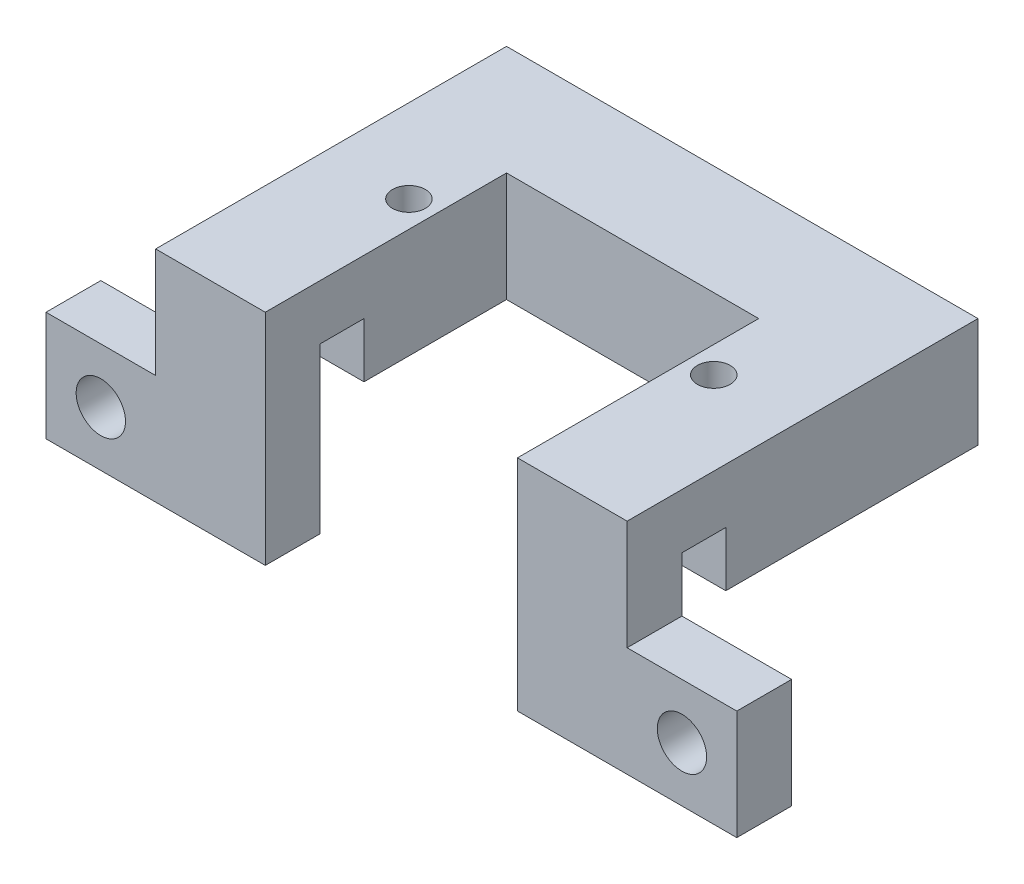
ISO-10303-21;
HEADER;
FILE_DESCRIPTION(('STEP AP214'),'2;1');
FILE_NAME('part.step','',(''),(''),'','','');
FILE_SCHEMA(('AUTOMOTIVE_DESIGN { 1 0 10303 214 1 1 1 1 }'));
ENDSEC;
DATA;
#1=APPLICATION_CONTEXT('core data for automotive mechanical design processes');
#2=APPLICATION_PROTOCOL_DEFINITION('international standard','automotive_design',2000,#1);
#3=PRODUCT_CONTEXT('',#1,'mechanical');
#4=PRODUCT('Part','Part','',(#3));
#5=PRODUCT_RELATED_PRODUCT_CATEGORY('part','',(#4));
#6=PRODUCT_DEFINITION_FORMATION('','',#4);
#7=PRODUCT_DEFINITION_CONTEXT('part definition',#1,'design');
#8=PRODUCT_DEFINITION('design','',#6,#7);
#9=PRODUCT_DEFINITION_SHAPE('','',#8);
#10=(LENGTH_UNIT() NAMED_UNIT(*) SI_UNIT(.MILLI.,.METRE.));
#11=(NAMED_UNIT(*) PLANE_ANGLE_UNIT() SI_UNIT($,.RADIAN.));
#12=(NAMED_UNIT(*) SI_UNIT($,.STERADIAN.) SOLID_ANGLE_UNIT());
#13=UNCERTAINTY_MEASURE_WITH_UNIT(LENGTH_MEASURE(1.E-05),#10,'distance_accuracy_value','');
#14=(GEOMETRIC_REPRESENTATION_CONTEXT(3) GLOBAL_UNCERTAINTY_ASSIGNED_CONTEXT((#13)) GLOBAL_UNIT_ASSIGNED_CONTEXT((#10,
#11,#12)) REPRESENTATION_CONTEXT('',''));
#15=CARTESIAN_POINT('',(0.,0.,0.));
#16=DIRECTION('',(0.,0.,1.));
#17=DIRECTION('',(1.,0.,0.));
#18=AXIS2_PLACEMENT_3D('',#15,#16,#17);
#19=CARTESIAN_POINT('',(21.5,10.,23.));
#20=DIRECTION('',(-1.,0.,0.));
#21=DIRECTION('',(0.,0.,1.));
#22=AXIS2_PLACEMENT_3D('',#19,#20,#21);
#23=PLANE('',#22);
#24=DIRECTION('',(0.,0.,1.));
#25=VECTOR('',#24,1.);
#26=CARTESIAN_POINT('',(21.5,0.,27.));
#27=LINE('',#26,#25);
#28=CARTESIAN_POINT('',(21.5,0.,27.));
#29=VERTEX_POINT('',#28);
#30=CARTESIAN_POINT('',(21.5,0.,32.));
#31=VERTEX_POINT('',#30);
#32=EDGE_CURVE('E54',#29,#31,#27,.T.);
#33=ORIENTED_EDGE('',*,*,#32,.F.);
#34=DIRECTION('',(0.,-1.,0.));
#35=VECTOR('',#34,1.);
#36=CARTESIAN_POINT('',(21.5,0.,27.));
#37=LINE('',#36,#35);
#38=CARTESIAN_POINT('',(21.5,5.,27.));
#39=VERTEX_POINT('',#38);
#40=EDGE_CURVE('E255',#39,#29,#37,.T.);
#41=ORIENTED_EDGE('',*,*,#40,.F.);
#42=DIRECTION('',(0.,0.,1.));
#43=VECTOR('',#42,1.);
#44=CARTESIAN_POINT('',(21.5,5.,27.));
#45=LINE('',#44,#43);
#46=CARTESIAN_POINT('',(21.5,5.,23.));
#47=VERTEX_POINT('',#46);
#48=EDGE_CURVE('E241',#47,#39,#45,.T.);
#49=ORIENTED_EDGE('',*,*,#48,.F.);
#50=DIRECTION('',(0.,1.,0.));
#51=VECTOR('',#50,1.);
#52=CARTESIAN_POINT('',(21.5,5.,23.));
#53=LINE('',#52,#51);
#54=CARTESIAN_POINT('',(21.5,0.,23.));
#55=VERTEX_POINT('',#54);
#56=EDGE_CURVE('E246',#55,#47,#53,.T.);
#57=ORIENTED_EDGE('',*,*,#56,.F.);
#58=DIRECTION('',(0.,0.,-1.));
#59=VECTOR('',#58,1.);
#60=CARTESIAN_POINT('',(21.5,0.,23.));
#61=LINE('',#60,#59);
#62=CARTESIAN_POINT('',(21.5,0.,0.));
#63=VERTEX_POINT('',#62);
#64=EDGE_CURVE('E313',#55,#63,#61,.T.);
#65=ORIENTED_EDGE('',*,*,#64,.T.);
#66=DIRECTION('',(0.,-1.,0.));
#67=VECTOR('',#66,1.);
#68=CARTESIAN_POINT('',(21.5,10.,0.));
#69=LINE('',#68,#67);
#70=CARTESIAN_POINT('',(21.5,10.,0.));
#71=VERTEX_POINT('',#70);
#72=EDGE_CURVE('E323',#71,#63,#69,.T.);
#73=ORIENTED_EDGE('',*,*,#72,.F.);
#74=DIRECTION('',(0.,0.,-1.));
#75=VECTOR('',#74,1.);
#76=CARTESIAN_POINT('',(21.5,10.,23.));
#77=LINE('',#76,#75);
#78=CARTESIAN_POINT('',(21.5,10.,32.));
#79=VERTEX_POINT('',#78);
#80=EDGE_CURVE('E177',#79,#71,#77,.T.);
#81=ORIENTED_EDGE('',*,*,#80,.F.);
#82=DIRECTION('',(0.,1.,0.));
#83=VECTOR('',#82,1.);
#84=CARTESIAN_POINT('',(21.5,0.,32.));
#85=LINE('',#84,#83);
#86=EDGE_CURVE('E175',#31,#79,#85,.T.);
#87=ORIENTED_EDGE('',*,*,#86,.F.);
#88=EDGE_LOOP('',(#33,#41,#49,#57,#65,#73,#81,#87));
#89=FACE_BOUND('',#88,.T.);
#90=ADVANCED_FACE('F37',(#89),#23,.F.);
#91=CARTESIAN_POINT('',(0.,0.,0.));
#92=DIRECTION('',(0.,1.,0.));
#93=DIRECTION('',(0.,0.,1.));
#94=AXIS2_PLACEMENT_3D('',#91,#92,#93);
#95=PLANE('',#94);
#96=CARTESIAN_POINT('',(-13.9,0.,16.5));
#97=DIRECTION('',(0.,1.,0.));
#98=DIRECTION('',(0.,0.,1.));
#99=AXIS2_PLACEMENT_3D('',#96,#97,#98);
#100=CIRCLE('',#99,1.5);
#101=CARTESIAN_POINT('',(-13.9,0.,18.));
#102=VERTEX_POINT('',#101);
#103=EDGE_CURVE('E297',#102,#102,#100,.T.);
#104=ORIENTED_EDGE('',*,*,#103,.T.);
#105=EDGE_LOOP('',(#104));
#106=FACE_BOUND('',#105,.T.);
#107=CARTESIAN_POINT('',(13.9,0.,16.5));
#108=DIRECTION('',(0.,1.,0.));
#109=DIRECTION('',(0.,0.,1.));
#110=AXIS2_PLACEMENT_3D('',#107,#108,#109);
#111=CIRCLE('',#110,1.5);
#112=CARTESIAN_POINT('',(13.9,0.,18.));
#113=VERTEX_POINT('',#112);
#114=EDGE_CURVE('E295',#113,#113,#111,.T.);
#115=ORIENTED_EDGE('',*,*,#114,.T.);
#116=EDGE_LOOP('',(#115));
#117=FACE_BOUND('',#116,.T.);
#118=ORIENTED_EDGE('',*,*,#64,.F.);
#119=DIRECTION('',(-1.,0.,0.));
#120=VECTOR('',#119,1.);
#121=CARTESIAN_POINT('',(0.,0.,23.));
#122=LINE('',#121,#120);
#123=CARTESIAN_POINT('',(11.5,0.,23.));
#124=VERTEX_POINT('',#123);
#125=EDGE_CURVE('E11',#55,#124,#122,.T.);
#126=ORIENTED_EDGE('',*,*,#125,.T.);
#127=DIRECTION('',(0.,0.,1.));
#128=VECTOR('',#127,1.);
#129=CARTESIAN_POINT('',(11.5,0.,10.));
#130=LINE('',#129,#128);
#131=CARTESIAN_POINT('',(11.5,0.,10.));
#132=VERTEX_POINT('',#131);
#133=EDGE_CURVE('E333',#132,#124,#130,.T.);
#134=ORIENTED_EDGE('',*,*,#133,.F.);
#135=DIRECTION('',(1.,0.,0.));
#136=VECTOR('',#135,1.);
#137=CARTESIAN_POINT('',(-11.5,0.,10.));
#138=LINE('',#137,#136);
#139=CARTESIAN_POINT('',(-11.5,0.,10.));
#140=VERTEX_POINT('',#139);
#141=EDGE_CURVE('E331',#140,#132,#138,.T.);
#142=ORIENTED_EDGE('',*,*,#141,.F.);
#143=DIRECTION('',(0.,0.,-1.));
#144=VECTOR('',#143,1.);
#145=CARTESIAN_POINT('',(-11.5,0.,23.));
#146=LINE('',#145,#144);
#147=CARTESIAN_POINT('',(-11.5,0.,23.));
#148=VERTEX_POINT('',#147);
#149=EDGE_CURVE('E329',#148,#140,#146,.T.);
#150=ORIENTED_EDGE('',*,*,#149,.F.);
#151=DIRECTION('',(1.,0.,0.));
#152=VECTOR('',#151,1.);
#153=CARTESIAN_POINT('',(-21.5,0.,23.));
#154=LINE('',#153,#152);
#155=CARTESIAN_POINT('',(-21.5,0.,23.));
#156=VERTEX_POINT('',#155);
#157=EDGE_CURVE('E264',#156,#148,#154,.T.);
#158=ORIENTED_EDGE('',*,*,#157,.F.);
#159=DIRECTION('',(0.,0.,1.));
#160=VECTOR('',#159,1.);
#161=CARTESIAN_POINT('',(-21.5,0.,0.));
#162=LINE('',#161,#160);
#163=CARTESIAN_POINT('',(-21.5,0.,0.));
#164=VERTEX_POINT('',#163);
#165=EDGE_CURVE('E326',#164,#156,#162,.T.);
#166=ORIENTED_EDGE('',*,*,#165,.F.);
#167=DIRECTION('',(-1.,0.,0.));
#168=VECTOR('',#167,1.);
#169=CARTESIAN_POINT('',(21.5,0.,0.));
#170=LINE('',#169,#168);
#171=EDGE_CURVE('E300',#63,#164,#170,.T.);
#172=ORIENTED_EDGE('',*,*,#171,.F.);
#173=EDGE_LOOP('',(#118,#126,#134,#142,#150,#158,#166,#172));
#174=FACE_BOUND('',#173,.T.);
#175=ADVANCED_FACE('F377',(#106,#117,#174),#95,.F.);
#176=CARTESIAN_POINT('',(21.5,10.,0.));
#177=DIRECTION('',(0.,0.,1.));
#178=DIRECTION('',(1.,0.,0.));
#179=AXIS2_PLACEMENT_3D('',#176,#177,#178);
#180=PLANE('',#179);
#181=ORIENTED_EDGE('',*,*,#171,.T.);
#182=DIRECTION('',(0.,-1.,0.));
#183=VECTOR('',#182,1.);
#184=CARTESIAN_POINT('',(-21.5,10.,0.));
#185=LINE('',#184,#183);
#186=CARTESIAN_POINT('',(-21.5,10.,0.));
#187=VERTEX_POINT('',#186);
#188=EDGE_CURVE('E46',#187,#164,#185,.T.);
#189=ORIENTED_EDGE('',*,*,#188,.F.);
#190=DIRECTION('',(-1.,0.,0.));
#191=VECTOR('',#190,1.);
#192=CARTESIAN_POINT('',(21.5,10.,0.));
#193=LINE('',#192,#191);
#194=EDGE_CURVE('E309',#71,#187,#193,.T.);
#195=ORIENTED_EDGE('',*,*,#194,.F.);
#196=ORIENTED_EDGE('',*,*,#72,.T.);
#197=EDGE_LOOP('',(#181,#189,#195,#196));
#198=FACE_BOUND('',#197,.T.);
#199=ADVANCED_FACE('F39',(#198),#180,.F.);
#200=CARTESIAN_POINT('',(-21.5,10.,0.));
#201=DIRECTION('',(1.,0.,0.));
#202=DIRECTION('',(0.,0.,-1.));
#203=AXIS2_PLACEMENT_3D('',#200,#201,#202);
#204=PLANE('',#203);
#205=DIRECTION('',(0.,-1.,0.));
#206=VECTOR('',#205,1.);
#207=CARTESIAN_POINT('',(-21.5,0.,27.));
#208=LINE('',#207,#206);
#209=CARTESIAN_POINT('',(-21.5,5.,27.));
#210=VERTEX_POINT('',#209);
#211=CARTESIAN_POINT('',(-21.5,0.,27.));
#212=VERTEX_POINT('',#211);
#213=EDGE_CURVE('E245',#210,#212,#208,.T.);
#214=ORIENTED_EDGE('',*,*,#213,.T.);
#215=DIRECTION('',(0.,0.,1.));
#216=VECTOR('',#215,1.);
#217=CARTESIAN_POINT('',(-21.5,0.,27.));
#218=LINE('',#217,#216);
#219=CARTESIAN_POINT('',(-21.5,0.,32.));
#220=VERTEX_POINT('',#219);
#221=EDGE_CURVE('E215',#212,#220,#218,.T.);
#222=ORIENTED_EDGE('',*,*,#221,.T.);
#223=DIRECTION('',(0.,1.,0.));
#224=VECTOR('',#223,1.);
#225=CARTESIAN_POINT('',(-21.5,0.,32.));
#226=LINE('',#225,#224);
#227=CARTESIAN_POINT('',(-21.5,10.,32.));
#228=VERTEX_POINT('',#227);
#229=EDGE_CURVE('E291',#220,#228,#226,.T.);
#230=ORIENTED_EDGE('',*,*,#229,.T.);
#231=DIRECTION('',(0.,0.,1.));
#232=VECTOR('',#231,1.);
#233=CARTESIAN_POINT('',(-21.5,10.,0.));
#234=LINE('',#233,#232);
#235=EDGE_CURVE('E312',#187,#228,#234,.T.);
#236=ORIENTED_EDGE('',*,*,#235,.F.);
#237=ORIENTED_EDGE('',*,*,#188,.T.);
#238=ORIENTED_EDGE('',*,*,#165,.T.);
#239=DIRECTION('',(0.,1.,0.));
#240=VECTOR('',#239,1.);
#241=CARTESIAN_POINT('',(-21.5,5.,23.));
#242=LINE('',#241,#240);
#243=CARTESIAN_POINT('',(-21.5,5.,23.));
#244=VERTEX_POINT('',#243);
#245=EDGE_CURVE('E249',#156,#244,#242,.T.);
#246=ORIENTED_EDGE('',*,*,#245,.T.);
#247=DIRECTION('',(0.,0.,1.));
#248=VECTOR('',#247,1.);
#249=CARTESIAN_POINT('',(-21.5,5.,27.));
#250=LINE('',#249,#248);
#251=EDGE_CURVE('E242',#244,#210,#250,.T.);
#252=ORIENTED_EDGE('',*,*,#251,.T.);
#253=EDGE_LOOP('',(#214,#222,#230,#236,#237,#238,#246,#252));
#254=FACE_BOUND('',#253,.T.);
#255=ADVANCED_FACE('F399',(#254),#204,.F.);
#256=CARTESIAN_POINT('',(-11.5,10.,23.));
#257=DIRECTION('',(-1.,0.,0.));
#258=DIRECTION('',(0.,0.,1.));
#259=AXIS2_PLACEMENT_3D('',#256,#257,#258);
#260=PLANE('',#259);
#261=DIRECTION('',(0.,0.,-1.));
#262=VECTOR('',#261,1.);
#263=CARTESIAN_POINT('',(-11.5,5.,23.));
#264=LINE('',#263,#262);
#265=CARTESIAN_POINT('',(-11.5,5.,27.));
#266=VERTEX_POINT('',#265);
#267=CARTESIAN_POINT('',(-11.5,5.,23.));
#268=VERTEX_POINT('',#267);
#269=EDGE_CURVE('E183',#266,#268,#264,.T.);
#270=ORIENTED_EDGE('',*,*,#269,.T.);
#271=DIRECTION('',(0.,-1.,0.));
#272=VECTOR('',#271,1.);
#273=CARTESIAN_POINT('',(-11.5,10.,23.));
#274=LINE('',#273,#272);
#275=EDGE_CURVE('E276',#268,#148,#274,.T.);
#276=ORIENTED_EDGE('',*,*,#275,.T.);
#277=ORIENTED_EDGE('',*,*,#149,.T.);
#278=DIRECTION('',(0.,-1.,0.));
#279=VECTOR('',#278,1.);
#280=CARTESIAN_POINT('',(-11.5,10.,10.));
#281=LINE('',#280,#279);
#282=CARTESIAN_POINT('',(-11.5,10.,10.));
#283=VERTEX_POINT('',#282);
#284=EDGE_CURVE('E342',#283,#140,#281,.T.);
#285=ORIENTED_EDGE('',*,*,#284,.F.);
#286=DIRECTION('',(0.,0.,-1.));
#287=VECTOR('',#286,1.);
#288=CARTESIAN_POINT('',(-11.5,10.,23.));
#289=LINE('',#288,#287);
#290=CARTESIAN_POINT('',(-11.5,10.,32.));
#291=VERTEX_POINT('',#290);
#292=EDGE_CURVE('E316',#291,#283,#289,.T.);
#293=ORIENTED_EDGE('',*,*,#292,.F.);
#294=DIRECTION('',(0.,1.,0.));
#295=VECTOR('',#294,1.);
#296=CARTESIAN_POINT('',(-11.5,0.,32.));
#297=LINE('',#296,#295);
#298=CARTESIAN_POINT('',(-11.5,-10.,32.));
#299=VERTEX_POINT('',#298);
#300=EDGE_CURVE('E292',#299,#291,#297,.T.);
#301=ORIENTED_EDGE('',*,*,#300,.F.);
#302=DIRECTION('',(0.,0.,1.));
#303=VECTOR('',#302,1.);
#304=CARTESIAN_POINT('',(-11.5,-10.,32.));
#305=LINE('',#304,#303);
#306=CARTESIAN_POINT('',(-11.5,-10.,27.));
#307=VERTEX_POINT('',#306);
#308=EDGE_CURVE('E236',#307,#299,#305,.T.);
#309=ORIENTED_EDGE('',*,*,#308,.F.);
#310=DIRECTION('',(0.,1.,0.));
#311=VECTOR('',#310,1.);
#312=CARTESIAN_POINT('',(-11.5,10.,27.));
#313=LINE('',#312,#311);
#314=EDGE_CURVE('E270',#307,#266,#313,.T.);
#315=ORIENTED_EDGE('',*,*,#314,.T.);
#316=EDGE_LOOP('',(#270,#276,#277,#285,#293,#301,#309,#315));
#317=FACE_BOUND('',#316,.T.);
#318=ADVANCED_FACE('F391',(#317),#260,.F.);
#319=CARTESIAN_POINT('',(-11.5,10.,10.));
#320=DIRECTION('',(0.,0.,-1.));
#321=DIRECTION('',(-1.,0.,0.));
#322=AXIS2_PLACEMENT_3D('',#319,#320,#321);
#323=PLANE('',#322);
#324=ORIENTED_EDGE('',*,*,#141,.T.);
#325=DIRECTION('',(0.,-1.,0.));
#326=VECTOR('',#325,1.);
#327=CARTESIAN_POINT('',(11.5,10.,10.));
#328=LINE('',#327,#326);
#329=CARTESIAN_POINT('',(11.5,10.,10.));
#330=VERTEX_POINT('',#329);
#331=EDGE_CURVE('E339',#330,#132,#328,.T.);
#332=ORIENTED_EDGE('',*,*,#331,.F.);
#333=DIRECTION('',(1.,0.,0.));
#334=VECTOR('',#333,1.);
#335=CARTESIAN_POINT('',(-11.5,10.,10.));
#336=LINE('',#335,#334);
#337=EDGE_CURVE('E318',#283,#330,#336,.T.);
#338=ORIENTED_EDGE('',*,*,#337,.F.);
#339=ORIENTED_EDGE('',*,*,#284,.T.);
#340=EDGE_LOOP('',(#324,#332,#338,#339));
#341=FACE_BOUND('',#340,.T.);
#342=ADVANCED_FACE('F386',(#341),#323,.F.);
#343=CARTESIAN_POINT('',(11.5,10.,10.));
#344=DIRECTION('',(1.,0.,0.));
#345=DIRECTION('',(0.,0.,-1.));
#346=AXIS2_PLACEMENT_3D('',#343,#344,#345);
#347=PLANE('',#346);
#348=ORIENTED_EDGE('',*,*,#133,.T.);
#349=DIRECTION('',(0.,1.,0.));
#350=VECTOR('',#349,1.);
#351=CARTESIAN_POINT('',(11.5,10.,23.));
#352=LINE('',#351,#350);
#353=CARTESIAN_POINT('',(11.5,5.,23.));
#354=VERTEX_POINT('',#353);
#355=EDGE_CURVE('E273',#124,#354,#352,.T.);
#356=ORIENTED_EDGE('',*,*,#355,.T.);
#357=DIRECTION('',(0.,0.,1.));
#358=VECTOR('',#357,1.);
#359=CARTESIAN_POINT('',(11.5,5.,10.));
#360=LINE('',#359,#358);
#361=CARTESIAN_POINT('',(11.5,5.,27.));
#362=VERTEX_POINT('',#361);
#363=EDGE_CURVE('E279',#354,#362,#360,.T.);
#364=ORIENTED_EDGE('',*,*,#363,.T.);
#365=DIRECTION('',(0.,-1.,0.));
#366=VECTOR('',#365,1.);
#367=CARTESIAN_POINT('',(11.5,10.,27.));
#368=LINE('',#367,#366);
#369=CARTESIAN_POINT('',(11.5,-10.,27.));
#370=VERTEX_POINT('',#369);
#371=EDGE_CURVE('E262',#362,#370,#368,.T.);
#372=ORIENTED_EDGE('',*,*,#371,.T.);
#373=DIRECTION('',(0.,0.,-1.));
#374=VECTOR('',#373,1.);
#375=CARTESIAN_POINT('',(11.5,-10.,32.));
#376=LINE('',#375,#374);
#377=CARTESIAN_POINT('',(11.5,-10.,32.));
#378=VERTEX_POINT('',#377);
#379=EDGE_CURVE('E230',#378,#370,#376,.T.);
#380=ORIENTED_EDGE('',*,*,#379,.F.);
#381=DIRECTION('',(0.,1.,0.));
#382=VECTOR('',#381,1.);
#383=CARTESIAN_POINT('',(11.5,0.,32.));
#384=LINE('',#383,#382);
#385=CARTESIAN_POINT('',(11.5,10.,32.));
#386=VERTEX_POINT('',#385);
#387=EDGE_CURVE('E182',#378,#386,#384,.T.);
#388=ORIENTED_EDGE('',*,*,#387,.T.);
#389=DIRECTION('',(0.,0.,1.));
#390=VECTOR('',#389,1.);
#391=CARTESIAN_POINT('',(11.5,10.,10.));
#392=LINE('',#391,#390);
#393=EDGE_CURVE('E320',#330,#386,#392,.T.);
#394=ORIENTED_EDGE('',*,*,#393,.F.);
#395=ORIENTED_EDGE('',*,*,#331,.T.);
#396=EDGE_LOOP('',(#348,#356,#364,#372,#380,#388,#394,#395));
#397=FACE_BOUND('',#396,.T.);
#398=ADVANCED_FACE('F381',(#397),#347,.F.);
#399=CARTESIAN_POINT('',(0.,10.,0.));
#400=DIRECTION('',(0.,1.,0.));
#401=DIRECTION('',(0.,0.,1.));
#402=AXIS2_PLACEMENT_3D('',#399,#400,#401);
#403=PLANE('',#402);
#404=CARTESIAN_POINT('',(-13.9,10.,16.5));
#405=DIRECTION('',(0.,1.,0.));
#406=DIRECTION('',(0.,0.,1.));
#407=AXIS2_PLACEMENT_3D('',#404,#405,#406);
#408=CIRCLE('',#407,1.5);
#409=CARTESIAN_POINT('',(-13.9,10.,18.));
#410=VERTEX_POINT('',#409);
#411=EDGE_CURVE('E301',#410,#410,#408,.T.);
#412=ORIENTED_EDGE('',*,*,#411,.F.);
#413=EDGE_LOOP('',(#412));
#414=FACE_BOUND('',#413,.T.);
#415=CARTESIAN_POINT('',(13.9,10.,16.5));
#416=DIRECTION('',(0.,1.,0.));
#417=DIRECTION('',(0.,0.,1.));
#418=AXIS2_PLACEMENT_3D('',#415,#416,#417);
#419=CIRCLE('',#418,1.5);
#420=CARTESIAN_POINT('',(13.9,10.,18.));
#421=VERTEX_POINT('',#420);
#422=EDGE_CURVE('E304',#421,#421,#419,.T.);
#423=ORIENTED_EDGE('',*,*,#422,.F.);
#424=EDGE_LOOP('',(#423));
#425=FACE_BOUND('',#424,.T.);
#426=ORIENTED_EDGE('',*,*,#194,.T.);
#427=ORIENTED_EDGE('',*,*,#235,.T.);
#428=DIRECTION('',(1.,0.,0.));
#429=VECTOR('',#428,1.);
#430=CARTESIAN_POINT('',(-11.5,10.,32.));
#431=LINE('',#430,#429);
#432=EDGE_CURVE('E288',#228,#291,#431,.T.);
#433=ORIENTED_EDGE('',*,*,#432,.T.);
#434=ORIENTED_EDGE('',*,*,#292,.T.);
#435=ORIENTED_EDGE('',*,*,#337,.T.);
#436=ORIENTED_EDGE('',*,*,#393,.T.);
#437=DIRECTION('',(1.,0.,0.));
#438=VECTOR('',#437,1.);
#439=CARTESIAN_POINT('',(11.5,10.,32.));
#440=LINE('',#439,#438);
#441=EDGE_CURVE('E285',#386,#79,#440,.T.);
#442=ORIENTED_EDGE('',*,*,#441,.T.);
#443=ORIENTED_EDGE('',*,*,#80,.T.);
#444=EDGE_LOOP('',(#426,#427,#433,#434,#435,#436,#442,#443));
#445=FACE_BOUND('',#444,.T.);
#446=ADVANCED_FACE('F404',(#414,#425,#445),#403,.T.);
#447=CARTESIAN_POINT('',(13.9,0.,16.5));
#448=DIRECTION('',(0.,1.,0.));
#449=DIRECTION('',(0.,0.,1.));
#450=AXIS2_PLACEMENT_3D('',#447,#448,#449);
#451=CYLINDRICAL_SURFACE('',#450,1.5);
#452=ORIENTED_EDGE('',*,*,#114,.F.);
#453=EDGE_LOOP('',(#452));
#454=FACE_BOUND('',#453,.T.);
#455=ORIENTED_EDGE('',*,*,#422,.T.);
#456=EDGE_LOOP('',(#455));
#457=FACE_BOUND('',#456,.T.);
#458=ADVANCED_FACE('F699',(#454,#457),#451,.F.);
#459=CARTESIAN_POINT('',(-13.9,0.,16.5));
#460=DIRECTION('',(0.,1.,0.));
#461=DIRECTION('',(0.,0.,1.));
#462=AXIS2_PLACEMENT_3D('',#459,#460,#461);
#463=CYLINDRICAL_SURFACE('',#462,1.5);
#464=ORIENTED_EDGE('',*,*,#103,.F.);
#465=EDGE_LOOP('',(#464));
#466=FACE_BOUND('',#465,.T.);
#467=ORIENTED_EDGE('',*,*,#411,.T.);
#468=EDGE_LOOP('',(#467));
#469=FACE_BOUND('',#468,.T.);
#470=ADVANCED_FACE('F577',(#466,#469),#463,.F.);
#471=CARTESIAN_POINT('',(-11.5,0.,32.));
#472=DIRECTION('',(0.,0.,1.));
#473=DIRECTION('',(1.,0.,0.));
#474=AXIS2_PLACEMENT_3D('',#471,#472,#473);
#475=PLANE('',#474);
#476=CARTESIAN_POINT('',(-26.5,-5.,32.));
#477=DIRECTION('',(0.,0.,1.));
#478=DIRECTION('',(1.,0.,0.));
#479=AXIS2_PLACEMENT_3D('',#476,#477,#478);
#480=CIRCLE('',#479,2.24999999999999);
#481=CARTESIAN_POINT('',(-24.25,-5.,32.));
#482=VERTEX_POINT('',#481);
#483=EDGE_CURVE('E355',#482,#482,#480,.T.);
#484=ORIENTED_EDGE('',*,*,#483,.F.);
#485=EDGE_LOOP('',(#484));
#486=FACE_BOUND('',#485,.T.);
#487=ORIENTED_EDGE('',*,*,#432,.F.);
#488=ORIENTED_EDGE('',*,*,#229,.F.);
#489=DIRECTION('',(-1.,0.,0.));
#490=VECTOR('',#489,1.);
#491=CARTESIAN_POINT('',(-21.5,0.,32.));
#492=LINE('',#491,#490);
#493=CARTESIAN_POINT('',(-31.5,0.,32.));
#494=VERTEX_POINT('',#493);
#495=EDGE_CURVE('E62',#220,#494,#492,.T.);
#496=ORIENTED_EDGE('',*,*,#495,.T.);
#497=DIRECTION('',(0.,-1.,0.));
#498=VECTOR('',#497,1.);
#499=CARTESIAN_POINT('',(-31.5,-10.,32.));
#500=LINE('',#499,#498);
#501=CARTESIAN_POINT('',(-31.5,-10.,32.));
#502=VERTEX_POINT('',#501);
#503=EDGE_CURVE('E212',#494,#502,#500,.T.);
#504=ORIENTED_EDGE('',*,*,#503,.T.);
#505=DIRECTION('',(-1.,0.,0.));
#506=VECTOR('',#505,1.);
#507=CARTESIAN_POINT('',(-21.5,-10.,32.));
#508=LINE('',#507,#506);
#509=EDGE_CURVE('E239',#299,#502,#508,.T.);
#510=ORIENTED_EDGE('',*,*,#509,.F.);
#511=ORIENTED_EDGE('',*,*,#300,.T.);
#512=EDGE_LOOP('',(#487,#488,#496,#504,#510,#511));
#513=FACE_BOUND('',#512,.T.);
#514=ADVANCED_FACE('F572',(#486,#513),#475,.T.);
#515=CARTESIAN_POINT('',(11.5,0.,32.));
#516=DIRECTION('',(0.,0.,1.));
#517=DIRECTION('',(1.,0.,0.));
#518=AXIS2_PLACEMENT_3D('',#515,#516,#517);
#519=PLANE('',#518);
#520=CARTESIAN_POINT('',(26.5,-5.,32.));
#521=DIRECTION('',(0.,0.,1.));
#522=DIRECTION('',(1.,0.,0.));
#523=AXIS2_PLACEMENT_3D('',#520,#521,#522);
#524=CIRCLE('',#523,2.24999999999999);
#525=CARTESIAN_POINT('',(28.75,-5.,32.));
#526=VERTEX_POINT('',#525);
#527=EDGE_CURVE('E347',#526,#526,#524,.T.);
#528=ORIENTED_EDGE('',*,*,#527,.F.);
#529=EDGE_LOOP('',(#528));
#530=FACE_BOUND('',#529,.T.);
#531=ORIENTED_EDGE('',*,*,#441,.F.);
#532=ORIENTED_EDGE('',*,*,#387,.F.);
#533=DIRECTION('',(-1.,0.,0.));
#534=VECTOR('',#533,1.);
#535=CARTESIAN_POINT('',(11.5,-10.,32.));
#536=LINE('',#535,#534);
#537=CARTESIAN_POINT('',(31.5,-10.,32.));
#538=VERTEX_POINT('',#537);
#539=EDGE_CURVE('E222',#538,#378,#536,.T.);
#540=ORIENTED_EDGE('',*,*,#539,.F.);
#541=DIRECTION('',(0.,1.,0.));
#542=VECTOR('',#541,1.);
#543=CARTESIAN_POINT('',(31.5,-10.,32.));
#544=LINE('',#543,#542);
#545=CARTESIAN_POINT('',(31.5,0.,32.));
#546=VERTEX_POINT('',#545);
#547=EDGE_CURVE('E198',#538,#546,#544,.T.);
#548=ORIENTED_EDGE('',*,*,#547,.T.);
#549=DIRECTION('',(-1.,0.,0.));
#550=VECTOR('',#549,1.);
#551=CARTESIAN_POINT('',(21.5,0.,32.));
#552=LINE('',#551,#550);
#553=EDGE_CURVE('E189',#546,#31,#552,.T.);
#554=ORIENTED_EDGE('',*,*,#553,.T.);
#555=ORIENTED_EDGE('',*,*,#86,.T.);
#556=EDGE_LOOP('',(#531,#532,#540,#548,#554,#555));
#557=FACE_BOUND('',#556,.T.);
#558=ADVANCED_FACE('F196',(#530,#557),#519,.T.);
#559=CARTESIAN_POINT('',(-21.5,0.,27.));
#560=DIRECTION('',(0.,0.,1.));
#561=DIRECTION('',(1.,0.,0.));
#562=AXIS2_PLACEMENT_3D('',#559,#560,#561);
#563=PLANE('',#562);
#564=CARTESIAN_POINT('',(26.5,-5.,27.));
#565=DIRECTION('',(0.,0.,1.));
#566=DIRECTION('',(1.,0.,0.));
#567=AXIS2_PLACEMENT_3D('',#564,#565,#566);
#568=CIRCLE('',#567,2.24999999999999);
#569=CARTESIAN_POINT('',(28.75,-5.,27.));
#570=VERTEX_POINT('',#569);
#571=EDGE_CURVE('E193',#570,#570,#568,.T.);
#572=ORIENTED_EDGE('',*,*,#571,.T.);
#573=EDGE_LOOP('',(#572));
#574=FACE_BOUND('',#573,.T.);
#575=DIRECTION('',(1.,0.,0.));
#576=VECTOR('',#575,1.);
#577=CARTESIAN_POINT('',(-21.5,5.,27.));
#578=LINE('',#577,#576);
#579=EDGE_CURVE('E252',#362,#39,#578,.T.);
#580=ORIENTED_EDGE('',*,*,#579,.T.);
#581=ORIENTED_EDGE('',*,*,#40,.T.);
#582=DIRECTION('',(-1.,0.,0.));
#583=VECTOR('',#582,1.);
#584=CARTESIAN_POINT('',(21.5,0.,27.));
#585=LINE('',#584,#583);
#586=CARTESIAN_POINT('',(31.5,0.,27.));
#587=VERTEX_POINT('',#586);
#588=EDGE_CURVE('E191',#587,#29,#585,.T.);
#589=ORIENTED_EDGE('',*,*,#588,.F.);
#590=DIRECTION('',(0.,1.,0.));
#591=VECTOR('',#590,1.);
#592=CARTESIAN_POINT('',(31.5,-10.,27.));
#593=LINE('',#592,#591);
#594=CARTESIAN_POINT('',(31.5,-10.,27.));
#595=VERTEX_POINT('',#594);
#596=EDGE_CURVE('E199',#595,#587,#593,.T.);
#597=ORIENTED_EDGE('',*,*,#596,.F.);
#598=DIRECTION('',(1.,0.,0.));
#599=VECTOR('',#598,1.);
#600=CARTESIAN_POINT('',(11.5,-10.,27.));
#601=LINE('',#600,#599);
#602=EDGE_CURVE('E228',#370,#595,#601,.T.);
#603=ORIENTED_EDGE('',*,*,#602,.F.);
#604=ORIENTED_EDGE('',*,*,#371,.F.);
#605=EDGE_LOOP('',(#580,#581,#589,#597,#603,#604));
#606=FACE_BOUND('',#605,.T.);
#607=ADVANCED_FACE('F365',(#574,#606),#563,.F.);
#608=CARTESIAN_POINT('',(-21.5,5.,23.));
#609=DIRECTION('',(0.,0.,-1.));
#610=DIRECTION('',(-1.,0.,0.));
#611=AXIS2_PLACEMENT_3D('',#608,#609,#610);
#612=PLANE('',#611);
#613=ORIENTED_EDGE('',*,*,#125,.F.);
#614=ORIENTED_EDGE('',*,*,#56,.T.);
#615=DIRECTION('',(1.,0.,0.));
#616=VECTOR('',#615,1.);
#617=CARTESIAN_POINT('',(-21.5,5.,23.));
#618=LINE('',#617,#616);
#619=EDGE_CURVE('E263',#354,#47,#618,.T.);
#620=ORIENTED_EDGE('',*,*,#619,.F.);
#621=ORIENTED_EDGE('',*,*,#355,.F.);
#622=EDGE_LOOP('',(#613,#614,#620,#621));
#623=FACE_BOUND('',#622,.T.);
#624=ADVANCED_FACE('F374',(#623),#612,.F.);
#625=CARTESIAN_POINT('',(-21.5,5.,27.));
#626=DIRECTION('',(0.,1.,0.));
#627=DIRECTION('',(0.,0.,1.));
#628=AXIS2_PLACEMENT_3D('',#625,#626,#627);
#629=PLANE('',#628);
#630=ORIENTED_EDGE('',*,*,#619,.T.);
#631=ORIENTED_EDGE('',*,*,#48,.T.);
#632=ORIENTED_EDGE('',*,*,#579,.F.);
#633=ORIENTED_EDGE('',*,*,#363,.F.);
#634=EDGE_LOOP('',(#630,#631,#632,#633));
#635=FACE_BOUND('',#634,.T.);
#636=ADVANCED_FACE('F371',(#635),#629,.F.);
#637=EDGE_CURVE('E266',#210,#266,#578,.T.);
#638=ORIENTED_EDGE('',*,*,#637,.F.);
#639=ORIENTED_EDGE('',*,*,#251,.F.);
#640=EDGE_CURVE('E259',#244,#268,#618,.T.);
#641=ORIENTED_EDGE('',*,*,#640,.T.);
#642=ORIENTED_EDGE('',*,*,#269,.F.);
#643=EDGE_LOOP('',(#638,#639,#641,#642));
#644=FACE_BOUND('',#643,.T.);
#645=ADVANCED_FACE('F396',(#644),#629,.F.);
#646=ORIENTED_EDGE('',*,*,#640,.F.);
#647=ORIENTED_EDGE('',*,*,#245,.F.);
#648=ORIENTED_EDGE('',*,*,#157,.T.);
#649=ORIENTED_EDGE('',*,*,#275,.F.);
#650=EDGE_LOOP('',(#646,#647,#648,#649));
#651=FACE_BOUND('',#650,.T.);
#652=ADVANCED_FACE('F393',(#651),#612,.F.);
#653=CARTESIAN_POINT('',(-26.5,-5.,27.));
#654=DIRECTION('',(0.,0.,1.));
#655=DIRECTION('',(1.,0.,0.));
#656=AXIS2_PLACEMENT_3D('',#653,#654,#655);
#657=CIRCLE('',#656,2.24999999999999);
#658=CARTESIAN_POINT('',(-24.25,-5.,27.));
#659=VERTEX_POINT('',#658);
#660=EDGE_CURVE('E41',#659,#659,#657,.T.);
#661=ORIENTED_EDGE('',*,*,#660,.T.);
#662=EDGE_LOOP('',(#661));
#663=FACE_BOUND('',#662,.T.);
#664=ORIENTED_EDGE('',*,*,#314,.F.);
#665=DIRECTION('',(1.,0.,0.));
#666=VECTOR('',#665,1.);
#667=CARTESIAN_POINT('',(-21.5,-10.,27.));
#668=LINE('',#667,#666);
#669=CARTESIAN_POINT('',(-31.5,-10.,27.));
#670=VERTEX_POINT('',#669);
#671=EDGE_CURVE('E233',#670,#307,#668,.T.);
#672=ORIENTED_EDGE('',*,*,#671,.F.);
#673=DIRECTION('',(0.,-1.,0.));
#674=VECTOR('',#673,1.);
#675=CARTESIAN_POINT('',(-31.5,-10.,27.));
#676=LINE('',#675,#674);
#677=CARTESIAN_POINT('',(-31.5,0.,27.));
#678=VERTEX_POINT('',#677);
#679=EDGE_CURVE('E211',#678,#670,#676,.T.);
#680=ORIENTED_EDGE('',*,*,#679,.F.);
#681=DIRECTION('',(-1.,0.,0.));
#682=VECTOR('',#681,1.);
#683=CARTESIAN_POINT('',(-21.5,0.,27.));
#684=LINE('',#683,#682);
#685=EDGE_CURVE('E208',#212,#678,#684,.T.);
#686=ORIENTED_EDGE('',*,*,#685,.F.);
#687=ORIENTED_EDGE('',*,*,#213,.F.);
#688=ORIENTED_EDGE('',*,*,#637,.T.);
#689=EDGE_LOOP('',(#664,#672,#680,#686,#687,#688));
#690=FACE_BOUND('',#689,.T.);
#691=ADVANCED_FACE('F420',(#663,#690),#563,.F.);
#692=CARTESIAN_POINT('',(0.,-10.,0.));
#693=DIRECTION('',(0.,-1.,0.));
#694=DIRECTION('',(0.,0.,-1.));
#695=AXIS2_PLACEMENT_3D('',#692,#693,#694);
#696=PLANE('',#695);
#697=ORIENTED_EDGE('',*,*,#509,.T.);
#698=DIRECTION('',(0.,0.,1.));
#699=VECTOR('',#698,1.);
#700=CARTESIAN_POINT('',(-31.5,-10.,27.));
#701=LINE('',#700,#699);
#702=EDGE_CURVE('E219',#670,#502,#701,.T.);
#703=ORIENTED_EDGE('',*,*,#702,.F.);
#704=ORIENTED_EDGE('',*,*,#671,.T.);
#705=ORIENTED_EDGE('',*,*,#308,.T.);
#706=EDGE_LOOP('',(#697,#703,#704,#705));
#707=FACE_BOUND('',#706,.T.);
#708=ADVANCED_FACE('F411',(#707),#696,.T.);
#709=CARTESIAN_POINT('',(0.,-10.,0.));
#710=DIRECTION('',(0.,-1.,0.));
#711=DIRECTION('',(0.,0.,-1.));
#712=AXIS2_PLACEMENT_3D('',#709,#710,#711);
#713=PLANE('',#712);
#714=ORIENTED_EDGE('',*,*,#379,.T.);
#715=ORIENTED_EDGE('',*,*,#602,.T.);
#716=DIRECTION('',(0.,0.,1.));
#717=VECTOR('',#716,1.);
#718=CARTESIAN_POINT('',(31.5,-10.,27.));
#719=LINE('',#718,#717);
#720=EDGE_CURVE('E206',#595,#538,#719,.T.);
#721=ORIENTED_EDGE('',*,*,#720,.T.);
#722=ORIENTED_EDGE('',*,*,#539,.T.);
#723=EDGE_LOOP('',(#714,#715,#721,#722));
#724=FACE_BOUND('',#723,.T.);
#725=ADVANCED_FACE('F408',(#724),#713,.T.);
#726=CARTESIAN_POINT('',(-31.5,-10.,27.));
#727=DIRECTION('',(-1.,0.,0.));
#728=DIRECTION('',(0.,0.,1.));
#729=AXIS2_PLACEMENT_3D('',#726,#727,#728);
#730=PLANE('',#729);
#731=ORIENTED_EDGE('',*,*,#503,.F.);
#732=DIRECTION('',(0.,0.,1.));
#733=VECTOR('',#732,1.);
#734=CARTESIAN_POINT('',(-31.5,0.,27.));
#735=LINE('',#734,#733);
#736=EDGE_CURVE('E223',#678,#494,#735,.T.);
#737=ORIENTED_EDGE('',*,*,#736,.F.);
#738=ORIENTED_EDGE('',*,*,#679,.T.);
#739=ORIENTED_EDGE('',*,*,#702,.T.);
#740=EDGE_LOOP('',(#731,#737,#738,#739));
#741=FACE_BOUND('',#740,.T.);
#742=ADVANCED_FACE('F410',(#741),#730,.T.);
#743=CARTESIAN_POINT('',(-21.5,0.,27.));
#744=DIRECTION('',(0.,1.,0.));
#745=DIRECTION('',(-1.,0.,0.));
#746=AXIS2_PLACEMENT_3D('',#743,#744,#745);
#747=PLANE('',#746);
#748=ORIENTED_EDGE('',*,*,#495,.F.);
#749=ORIENTED_EDGE('',*,*,#221,.F.);
#750=ORIENTED_EDGE('',*,*,#685,.T.);
#751=ORIENTED_EDGE('',*,*,#736,.T.);
#752=EDGE_LOOP('',(#748,#749,#750,#751));
#753=FACE_BOUND('',#752,.T.);
#754=ADVANCED_FACE('F417',(#753),#747,.T.);
#755=CARTESIAN_POINT('',(21.5,0.,27.));
#756=DIRECTION('',(0.,1.,0.));
#757=DIRECTION('',(0.,0.,1.));
#758=AXIS2_PLACEMENT_3D('',#755,#756,#757);
#759=PLANE('',#758);
#760=ORIENTED_EDGE('',*,*,#553,.F.);
#761=DIRECTION('',(0.,0.,1.));
#762=VECTOR('',#761,1.);
#763=CARTESIAN_POINT('',(31.5,0.,27.));
#764=LINE('',#763,#762);
#765=EDGE_CURVE('E192',#587,#546,#764,.T.);
#766=ORIENTED_EDGE('',*,*,#765,.F.);
#767=ORIENTED_EDGE('',*,*,#588,.T.);
#768=ORIENTED_EDGE('',*,*,#32,.T.);
#769=EDGE_LOOP('',(#760,#766,#767,#768));
#770=FACE_BOUND('',#769,.T.);
#771=ADVANCED_FACE('F188',(#770),#759,.T.);
#772=CARTESIAN_POINT('',(31.5,-10.,27.));
#773=DIRECTION('',(1.,0.,0.));
#774=DIRECTION('',(0.,0.,-1.));
#775=AXIS2_PLACEMENT_3D('',#772,#773,#774);
#776=PLANE('',#775);
#777=ORIENTED_EDGE('',*,*,#547,.F.);
#778=ORIENTED_EDGE('',*,*,#720,.F.);
#779=ORIENTED_EDGE('',*,*,#596,.T.);
#780=ORIENTED_EDGE('',*,*,#765,.T.);
#781=EDGE_LOOP('',(#777,#778,#779,#780));
#782=FACE_BOUND('',#781,.T.);
#783=ADVANCED_FACE('F360',(#782),#776,.T.);
#784=CARTESIAN_POINT('',(26.5,-5.,32.));
#785=DIRECTION('',(0.,0.,1.));
#786=DIRECTION('',(1.,0.,0.));
#787=AXIS2_PLACEMENT_3D('',#784,#785,#786);
#788=CYLINDRICAL_SURFACE('',#787,2.24999999999999);
#789=ORIENTED_EDGE('',*,*,#527,.T.);
#790=EDGE_LOOP('',(#789));
#791=FACE_BOUND('',#790,.T.);
#792=ORIENTED_EDGE('',*,*,#571,.F.);
#793=EDGE_LOOP('',(#792));
#794=FACE_BOUND('',#793,.T.);
#795=ADVANCED_FACE('F564',(#791,#794),#788,.F.);
#796=CARTESIAN_POINT('',(-26.5,-5.,32.));
#797=DIRECTION('',(0.,0.,1.));
#798=DIRECTION('',(1.,0.,0.));
#799=AXIS2_PLACEMENT_3D('',#796,#797,#798);
#800=CYLINDRICAL_SURFACE('',#799,2.24999999999999);
#801=ORIENTED_EDGE('',*,*,#483,.T.);
#802=EDGE_LOOP('',(#801));
#803=FACE_BOUND('',#802,.T.);
#804=ORIENTED_EDGE('',*,*,#660,.F.);
#805=EDGE_LOOP('',(#804));
#806=FACE_BOUND('',#805,.T.);
#807=ADVANCED_FACE('F611',(#803,#806),#800,.F.);
#808=CLOSED_SHELL('',(#90,#175,#199,#255,#318,#342,#398,#446,#458,#470,#514,#558,#607,#624,#636,
#645,#652,#691,#708,#725,#742,#754,#771,#783,#795,#807));
#809=MANIFOLD_SOLID_BREP('B2',#808);
#810=ADVANCED_BREP_SHAPE_REPRESENTATION('',(#18,#809),#14);
#811=SHAPE_DEFINITION_REPRESENTATION(#9,#810);
ENDSEC;
END-ISO-10303-21;
